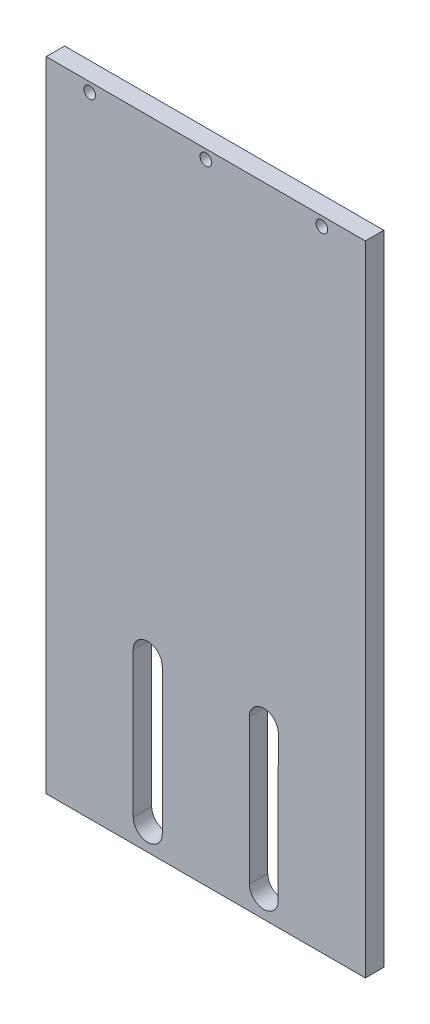
ISO-10303-21;
HEADER;
FILE_DESCRIPTION(('STEP AP214'),'2;1');
FILE_NAME('part.step','',(''),(''),'','','');
FILE_SCHEMA(('AUTOMOTIVE_DESIGN { 1 0 10303 214 1 1 1 1 }'));
ENDSEC;
DATA;
#1=APPLICATION_CONTEXT('core data for automotive mechanical design processes');
#2=APPLICATION_PROTOCOL_DEFINITION('international standard','automotive_design',2000,#1);
#3=PRODUCT_CONTEXT('',#1,'mechanical');
#4=PRODUCT('Part','Part','',(#3));
#5=PRODUCT_RELATED_PRODUCT_CATEGORY('part','',(#4));
#6=PRODUCT_DEFINITION_FORMATION('','',#4);
#7=PRODUCT_DEFINITION_CONTEXT('part definition',#1,'design');
#8=PRODUCT_DEFINITION('design','',#6,#7);
#9=PRODUCT_DEFINITION_SHAPE('','',#8);
#10=(LENGTH_UNIT() NAMED_UNIT(*) SI_UNIT(.MILLI.,.METRE.));
#11=(NAMED_UNIT(*) PLANE_ANGLE_UNIT() SI_UNIT($,.RADIAN.));
#12=(NAMED_UNIT(*) SI_UNIT($,.STERADIAN.) SOLID_ANGLE_UNIT());
#13=UNCERTAINTY_MEASURE_WITH_UNIT(LENGTH_MEASURE(1.E-05),#10,'distance_accuracy_value','');
#14=(GEOMETRIC_REPRESENTATION_CONTEXT(3) GLOBAL_UNCERTAINTY_ASSIGNED_CONTEXT((#13)) GLOBAL_UNIT_ASSIGNED_CONTEXT((#10,
#11,#12)) REPRESENTATION_CONTEXT('',''));
#15=CARTESIAN_POINT('',(0.,0.,0.));
#16=DIRECTION('',(0.,0.,1.));
#17=DIRECTION('',(1.,0.,0.));
#18=AXIS2_PLACEMENT_3D('',#15,#16,#17);
#19=CARTESIAN_POINT('',(0.,0.,6.35));
#20=DIRECTION('',(0.,0.,-1.));
#21=DIRECTION('',(-1.,0.,0.));
#22=AXIS2_PLACEMENT_3D('',#19,#20,#21);
#23=PLANE('',#22);
#24=CARTESIAN_POINT('',(0.,106.825,6.35));
#25=DIRECTION('',(0.,0.,1.));
#26=DIRECTION('',(1.,0.,0.));
#27=AXIS2_PLACEMENT_3D('',#24,#25,#26);
#28=CIRCLE('',#27,2.);
#29=CARTESIAN_POINT('',(2.,106.825,6.35));
#30=VERTEX_POINT('',#29);
#31=EDGE_CURVE('E158',#30,#30,#28,.T.);
#32=ORIENTED_EDGE('',*,*,#31,.F.);
#33=EDGE_LOOP('',(#32));
#34=FACE_BOUND('',#33,.T.);
#35=CARTESIAN_POINT('',(-40.,106.825,6.35));
#36=DIRECTION('',(0.,0.,1.));
#37=DIRECTION('',(1.,0.,0.));
#38=AXIS2_PLACEMENT_3D('',#35,#36,#37);
#39=CIRCLE('',#38,2.);
#40=CARTESIAN_POINT('',(-38.,106.825,6.35));
#41=VERTEX_POINT('',#40);
#42=EDGE_CURVE('E195',#41,#41,#39,.T.);
#43=ORIENTED_EDGE('',*,*,#42,.F.);
#44=EDGE_LOOP('',(#43));
#45=FACE_BOUND('',#44,.T.);
#46=DIRECTION('',(0.,1.,0.));
#47=VECTOR('',#46,1.);
#48=CARTESIAN_POINT('',(55.,-110.,6.35));
#49=LINE('',#48,#47);
#50=CARTESIAN_POINT('',(55.,-110.,6.35));
#51=VERTEX_POINT('',#50);
#52=CARTESIAN_POINT('',(55.,110.,6.35));
#53=VERTEX_POINT('',#52);
#54=EDGE_CURVE('E207',#51,#53,#49,.T.);
#55=ORIENTED_EDGE('',*,*,#54,.T.);
#56=DIRECTION('',(-1.,0.,0.));
#57=VECTOR('',#56,1.);
#58=CARTESIAN_POINT('',(-55.,110.,6.35));
#59=LINE('',#58,#57);
#60=CARTESIAN_POINT('',(-55.,110.,6.35));
#61=VERTEX_POINT('',#60);
#62=EDGE_CURVE('E210',#53,#61,#59,.T.);
#63=ORIENTED_EDGE('',*,*,#62,.T.);
#64=DIRECTION('',(0.,-1.,0.));
#65=VECTOR('',#64,1.);
#66=CARTESIAN_POINT('',(-55.,-110.,6.35));
#67=LINE('',#66,#65);
#68=CARTESIAN_POINT('',(-55.,-110.,6.35));
#69=VERTEX_POINT('',#68);
#70=EDGE_CURVE('E213',#61,#69,#67,.T.);
#71=ORIENTED_EDGE('',*,*,#70,.T.);
#72=DIRECTION('',(1.,0.,0.));
#73=VECTOR('',#72,1.);
#74=CARTESIAN_POINT('',(-55.,-110.,6.35));
#75=LINE('',#74,#73);
#76=EDGE_CURVE('E215',#69,#51,#75,.T.);
#77=ORIENTED_EDGE('',*,*,#76,.T.);
#78=EDGE_LOOP('',(#55,#63,#71,#77));
#79=FACE_BOUND('',#78,.T.);
#80=CARTESIAN_POINT('',(40.,106.825,6.35));
#81=DIRECTION('',(0.,0.,1.));
#82=DIRECTION('',(1.,0.,0.));
#83=AXIS2_PLACEMENT_3D('',#80,#81,#82);
#84=CIRCLE('',#83,2.);
#85=CARTESIAN_POINT('',(42.,106.825,6.35));
#86=VERTEX_POINT('',#85);
#87=EDGE_CURVE('E201',#86,#86,#84,.T.);
#88=ORIENTED_EDGE('',*,*,#87,.F.);
#89=EDGE_LOOP('',(#88));
#90=FACE_BOUND('',#89,.T.);
#91=CARTESIAN_POINT('',(20.,-52.,6.35));
#92=DIRECTION('',(0.,0.,1.));
#93=DIRECTION('',(1.,0.,0.));
#94=AXIS2_PLACEMENT_3D('',#91,#92,#93);
#95=CIRCLE('',#94,4.99999999999999);
#96=CARTESIAN_POINT('',(25.,-52.,6.35));
#97=VERTEX_POINT('',#96);
#98=CARTESIAN_POINT('',(15.,-52.,6.35));
#99=VERTEX_POINT('',#98);
#100=EDGE_CURVE('E164',#97,#99,#95,.T.);
#101=ORIENTED_EDGE('',*,*,#100,.F.);
#102=DIRECTION('',(0.00273615288829187,0.99999625672668,0.));
#103=VECTOR('',#102,1.);
#104=CARTESIAN_POINT('',(25.,-52.,6.35));
#105=LINE('',#104,#103);
#106=CARTESIAN_POINT('',(24.8599768517967,-103.175,6.35));
#107=VERTEX_POINT('',#106);
#108=EDGE_CURVE('E172',#107,#97,#105,.T.);
#109=ORIENTED_EDGE('',*,*,#108,.F.);
#110=CARTESIAN_POINT('',(20.,-102.,6.35));
#111=DIRECTION('',(0.,0.,1.));
#112=DIRECTION('',(1.,0.,0.));
#113=AXIS2_PLACEMENT_3D('',#110,#111,#112);
#114=CIRCLE('',#113,5.);
#115=CARTESIAN_POINT('',(15.,-102.,6.35));
#116=VERTEX_POINT('',#115);
#117=EDGE_CURVE('E169',#116,#107,#114,.T.);
#118=ORIENTED_EDGE('',*,*,#117,.F.);
#119=DIRECTION('',(0.,-1.,0.));
#120=VECTOR('',#119,1.);
#121=CARTESIAN_POINT('',(15.,-52.,6.35));
#122=LINE('',#121,#120);
#123=EDGE_CURVE('E166',#99,#116,#122,.T.);
#124=ORIENTED_EDGE('',*,*,#123,.F.);
#125=EDGE_LOOP('',(#101,#109,#118,#124));
#126=FACE_BOUND('',#125,.T.);
#127=CARTESIAN_POINT('',(-20.,-52.,6.35));
#128=DIRECTION('',(0.,0.,1.));
#129=DIRECTION('',(1.,0.,0.));
#130=AXIS2_PLACEMENT_3D('',#127,#128,#129);
#131=CIRCLE('',#130,5.);
#132=CARTESIAN_POINT('',(-15.,-52.,6.35));
#133=VERTEX_POINT('',#132);
#134=CARTESIAN_POINT('',(-25.,-52.,6.35));
#135=VERTEX_POINT('',#134);
#136=EDGE_CURVE('E122',#133,#135,#131,.T.);
#137=ORIENTED_EDGE('',*,*,#136,.F.);
#138=DIRECTION('',(0.,1.,0.));
#139=VECTOR('',#138,1.);
#140=CARTESIAN_POINT('',(-15.,-52.,6.35));
#141=LINE('',#140,#139);
#142=CARTESIAN_POINT('',(-15.,-102.,6.35));
#143=VERTEX_POINT('',#142);
#144=EDGE_CURVE('E144',#143,#133,#141,.T.);
#145=ORIENTED_EDGE('',*,*,#144,.F.);
#146=CARTESIAN_POINT('',(-20.,-102.,6.35));
#147=DIRECTION('',(0.,0.,1.));
#148=DIRECTION('',(1.,0.,0.));
#149=AXIS2_PLACEMENT_3D('',#146,#147,#148);
#150=CIRCLE('',#149,5.);
#151=CARTESIAN_POINT('',(-25.,-102.,6.35));
#152=VERTEX_POINT('',#151);
#153=EDGE_CURVE('E142',#152,#143,#150,.T.);
#154=ORIENTED_EDGE('',*,*,#153,.F.);
#155=DIRECTION('',(0.,-1.,0.));
#156=VECTOR('',#155,1.);
#157=CARTESIAN_POINT('',(-25.,-52.,6.35));
#158=LINE('',#157,#156);
#159=EDGE_CURVE('E130',#135,#152,#158,.T.);
#160=ORIENTED_EDGE('',*,*,#159,.F.);
#161=EDGE_LOOP('',(#137,#145,#154,#160));
#162=FACE_BOUND('',#161,.T.);
#163=ADVANCED_FACE('F33',(#34,#45,#79,#90,#126,#162),#23,.F.);
#164=CARTESIAN_POINT('',(0.,0.,0.));
#165=DIRECTION('',(0.,0.,-1.));
#166=DIRECTION('',(-1.,0.,0.));
#167=AXIS2_PLACEMENT_3D('',#164,#165,#166);
#168=PLANE('',#167);
#169=CARTESIAN_POINT('',(0.,106.825,0.));
#170=DIRECTION('',(0.,0.,1.));
#171=DIRECTION('',(1.,0.,0.));
#172=AXIS2_PLACEMENT_3D('',#169,#170,#171);
#173=CIRCLE('',#172,2.);
#174=CARTESIAN_POINT('',(2.,106.825,0.));
#175=VERTEX_POINT('',#174);
#176=EDGE_CURVE('E138',#175,#175,#173,.T.);
#177=ORIENTED_EDGE('',*,*,#176,.T.);
#178=EDGE_LOOP('',(#177));
#179=FACE_BOUND('',#178,.T.);
#180=CARTESIAN_POINT('',(-40.,106.825,0.));
#181=DIRECTION('',(0.,0.,1.));
#182=DIRECTION('',(1.,0.,0.));
#183=AXIS2_PLACEMENT_3D('',#180,#181,#182);
#184=CIRCLE('',#183,2.);
#185=CARTESIAN_POINT('',(-38.,106.825,0.));
#186=VERTEX_POINT('',#185);
#187=EDGE_CURVE('E194',#186,#186,#184,.T.);
#188=ORIENTED_EDGE('',*,*,#187,.T.);
#189=EDGE_LOOP('',(#188));
#190=FACE_BOUND('',#189,.T.);
#191=DIRECTION('',(0.,1.,0.));
#192=VECTOR('',#191,1.);
#193=CARTESIAN_POINT('',(55.,-110.,0.));
#194=LINE('',#193,#192);
#195=CARTESIAN_POINT('',(55.,-110.,0.));
#196=VERTEX_POINT('',#195);
#197=CARTESIAN_POINT('',(55.,110.,0.));
#198=VERTEX_POINT('',#197);
#199=EDGE_CURVE('E204',#196,#198,#194,.T.);
#200=ORIENTED_EDGE('',*,*,#199,.F.);
#201=DIRECTION('',(1.,0.,0.));
#202=VECTOR('',#201,1.);
#203=CARTESIAN_POINT('',(-55.,-110.,0.));
#204=LINE('',#203,#202);
#205=CARTESIAN_POINT('',(-55.,-110.,0.));
#206=VERTEX_POINT('',#205);
#207=EDGE_CURVE('E211',#206,#196,#204,.T.);
#208=ORIENTED_EDGE('',*,*,#207,.F.);
#209=DIRECTION('',(0.,-1.,0.));
#210=VECTOR('',#209,1.);
#211=CARTESIAN_POINT('',(-55.,-110.,0.));
#212=LINE('',#211,#210);
#213=CARTESIAN_POINT('',(-55.,110.,0.));
#214=VERTEX_POINT('',#213);
#215=EDGE_CURVE('E222',#214,#206,#212,.T.);
#216=ORIENTED_EDGE('',*,*,#215,.F.);
#217=DIRECTION('',(-1.,0.,0.));
#218=VECTOR('',#217,1.);
#219=CARTESIAN_POINT('',(-55.,110.,0.));
#220=LINE('',#219,#218);
#221=EDGE_CURVE('E220',#198,#214,#220,.T.);
#222=ORIENTED_EDGE('',*,*,#221,.F.);
#223=EDGE_LOOP('',(#200,#208,#216,#222));
#224=FACE_BOUND('',#223,.T.);
#225=CARTESIAN_POINT('',(40.,106.825,0.));
#226=DIRECTION('',(0.,0.,1.));
#227=DIRECTION('',(1.,0.,0.));
#228=AXIS2_PLACEMENT_3D('',#225,#226,#227);
#229=CIRCLE('',#228,2.);
#230=CARTESIAN_POINT('',(42.,106.825,0.));
#231=VERTEX_POINT('',#230);
#232=EDGE_CURVE('E198',#231,#231,#229,.T.);
#233=ORIENTED_EDGE('',*,*,#232,.T.);
#234=EDGE_LOOP('',(#233));
#235=FACE_BOUND('',#234,.T.);
#236=DIRECTION('',(0.00273615288829187,0.99999625672668,0.));
#237=VECTOR('',#236,1.);
#238=CARTESIAN_POINT('',(25.,-52.,0.));
#239=LINE('',#238,#237);
#240=CARTESIAN_POINT('',(24.8599768517967,-103.175,0.));
#241=VERTEX_POINT('',#240);
#242=CARTESIAN_POINT('',(25.,-52.,0.));
#243=VERTEX_POINT('',#242);
#244=EDGE_CURVE('E167',#241,#243,#239,.T.);
#245=ORIENTED_EDGE('',*,*,#244,.T.);
#246=CARTESIAN_POINT('',(20.,-52.,0.));
#247=DIRECTION('',(0.,0.,1.));
#248=DIRECTION('',(1.,0.,0.));
#249=AXIS2_PLACEMENT_3D('',#246,#247,#248);
#250=CIRCLE('',#249,4.99999999999999);
#251=CARTESIAN_POINT('',(15.,-52.,0.));
#252=VERTEX_POINT('',#251);
#253=EDGE_CURVE('E161',#243,#252,#250,.T.);
#254=ORIENTED_EDGE('',*,*,#253,.T.);
#255=DIRECTION('',(0.,-1.,0.));
#256=VECTOR('',#255,1.);
#257=CARTESIAN_POINT('',(15.,-52.,0.));
#258=LINE('',#257,#256);
#259=CARTESIAN_POINT('',(15.,-102.,0.));
#260=VERTEX_POINT('',#259);
#261=EDGE_CURVE('E177',#252,#260,#258,.T.);
#262=ORIENTED_EDGE('',*,*,#261,.T.);
#263=CARTESIAN_POINT('',(20.,-102.,0.));
#264=DIRECTION('',(0.,0.,1.));
#265=DIRECTION('',(1.,0.,0.));
#266=AXIS2_PLACEMENT_3D('',#263,#264,#265);
#267=CIRCLE('',#266,5.);
#268=EDGE_CURVE('E180',#260,#241,#267,.T.);
#269=ORIENTED_EDGE('',*,*,#268,.T.);
#270=EDGE_LOOP('',(#245,#254,#262,#269));
#271=FACE_BOUND('',#270,.T.);
#272=DIRECTION('',(0.,1.,0.));
#273=VECTOR('',#272,1.);
#274=CARTESIAN_POINT('',(-15.,-52.,0.));
#275=LINE('',#274,#273);
#276=CARTESIAN_POINT('',(-15.,-102.,0.));
#277=VERTEX_POINT('',#276);
#278=CARTESIAN_POINT('',(-15.,-52.,0.));
#279=VERTEX_POINT('',#278);
#280=EDGE_CURVE('E131',#277,#279,#275,.T.);
#281=ORIENTED_EDGE('',*,*,#280,.T.);
#282=CARTESIAN_POINT('',(-20.,-52.,0.));
#283=DIRECTION('',(0.,0.,1.));
#284=DIRECTION('',(1.,0.,0.));
#285=AXIS2_PLACEMENT_3D('',#282,#283,#284);
#286=CIRCLE('',#285,5.);
#287=CARTESIAN_POINT('',(-25.,-52.,0.));
#288=VERTEX_POINT('',#287);
#289=EDGE_CURVE('E56',#279,#288,#286,.T.);
#290=ORIENTED_EDGE('',*,*,#289,.T.);
#291=DIRECTION('',(0.,-1.,0.));
#292=VECTOR('',#291,1.);
#293=CARTESIAN_POINT('',(-25.,-52.,0.));
#294=LINE('',#293,#292);
#295=CARTESIAN_POINT('',(-25.,-102.,0.));
#296=VERTEX_POINT('',#295);
#297=EDGE_CURVE('E137',#288,#296,#294,.T.);
#298=ORIENTED_EDGE('',*,*,#297,.T.);
#299=CARTESIAN_POINT('',(-20.,-102.,0.));
#300=DIRECTION('',(0.,0.,1.));
#301=DIRECTION('',(1.,0.,0.));
#302=AXIS2_PLACEMENT_3D('',#299,#300,#301);
#303=CIRCLE('',#302,5.);
#304=EDGE_CURVE('E150',#296,#277,#303,.T.);
#305=ORIENTED_EDGE('',*,*,#304,.T.);
#306=EDGE_LOOP('',(#281,#290,#298,#305));
#307=FACE_BOUND('',#306,.T.);
#308=ADVANCED_FACE('F240',(#179,#190,#224,#235,#271,#307),#168,.T.);
#309=CARTESIAN_POINT('',(55.,-110.,6.35));
#310=DIRECTION('',(-1.,0.,0.));
#311=DIRECTION('',(0.,0.,1.));
#312=AXIS2_PLACEMENT_3D('',#309,#310,#311);
#313=PLANE('',#312);
#314=ORIENTED_EDGE('',*,*,#199,.T.);
#315=DIRECTION('',(0.,0.,-1.));
#316=VECTOR('',#315,1.);
#317=CARTESIAN_POINT('',(55.,110.,6.35));
#318=LINE('',#317,#316);
#319=EDGE_CURVE('E11',#53,#198,#318,.T.);
#320=ORIENTED_EDGE('',*,*,#319,.F.);
#321=ORIENTED_EDGE('',*,*,#54,.F.);
#322=DIRECTION('',(0.,0.,-1.));
#323=VECTOR('',#322,1.);
#324=CARTESIAN_POINT('',(55.,-110.,6.35));
#325=LINE('',#324,#323);
#326=EDGE_CURVE('E217',#51,#196,#325,.T.);
#327=ORIENTED_EDGE('',*,*,#326,.T.);
#328=EDGE_LOOP('',(#314,#320,#321,#327));
#329=FACE_BOUND('',#328,.T.);
#330=ADVANCED_FACE('F35',(#329),#313,.F.);
#331=CARTESIAN_POINT('',(-55.,110.,6.35));
#332=DIRECTION('',(0.,-1.,0.));
#333=DIRECTION('',(0.,0.,-1.));
#334=AXIS2_PLACEMENT_3D('',#331,#332,#333);
#335=PLANE('',#334);
#336=ORIENTED_EDGE('',*,*,#221,.T.);
#337=DIRECTION('',(0.,0.,-1.));
#338=VECTOR('',#337,1.);
#339=CARTESIAN_POINT('',(-55.,110.,6.35));
#340=LINE('',#339,#338);
#341=EDGE_CURVE('E41',#61,#214,#340,.T.);
#342=ORIENTED_EDGE('',*,*,#341,.F.);
#343=ORIENTED_EDGE('',*,*,#62,.F.);
#344=ORIENTED_EDGE('',*,*,#319,.T.);
#345=EDGE_LOOP('',(#336,#342,#343,#344));
#346=FACE_BOUND('',#345,.T.);
#347=ADVANCED_FACE('F251',(#346),#335,.F.);
#348=CARTESIAN_POINT('',(-55.,-110.,6.35));
#349=DIRECTION('',(1.,0.,0.));
#350=DIRECTION('',(0.,0.,-1.));
#351=AXIS2_PLACEMENT_3D('',#348,#349,#350);
#352=PLANE('',#351);
#353=ORIENTED_EDGE('',*,*,#215,.T.);
#354=DIRECTION('',(0.,0.,-1.));
#355=VECTOR('',#354,1.);
#356=CARTESIAN_POINT('',(-55.,-110.,6.35));
#357=LINE('',#356,#355);
#358=EDGE_CURVE('E227',#69,#206,#357,.T.);
#359=ORIENTED_EDGE('',*,*,#358,.F.);
#360=ORIENTED_EDGE('',*,*,#70,.F.);
#361=ORIENTED_EDGE('',*,*,#341,.T.);
#362=EDGE_LOOP('',(#353,#359,#360,#361));
#363=FACE_BOUND('',#362,.T.);
#364=ADVANCED_FACE('F234',(#363),#352,.F.);
#365=CARTESIAN_POINT('',(-55.,-110.,6.35));
#366=DIRECTION('',(0.,1.,0.));
#367=DIRECTION('',(0.,0.,1.));
#368=AXIS2_PLACEMENT_3D('',#365,#366,#367);
#369=PLANE('',#368);
#370=ORIENTED_EDGE('',*,*,#207,.T.);
#371=ORIENTED_EDGE('',*,*,#326,.F.);
#372=ORIENTED_EDGE('',*,*,#76,.F.);
#373=ORIENTED_EDGE('',*,*,#358,.T.);
#374=EDGE_LOOP('',(#370,#371,#372,#373));
#375=FACE_BOUND('',#374,.T.);
#376=ADVANCED_FACE('F244',(#375),#369,.F.);
#377=CARTESIAN_POINT('',(40.,106.825,6.35));
#378=DIRECTION('',(0.,0.,-1.));
#379=DIRECTION('',(-1.,0.,0.));
#380=AXIS2_PLACEMENT_3D('',#377,#378,#379);
#381=CYLINDRICAL_SURFACE('',#380,2.);
#382=ORIENTED_EDGE('',*,*,#87,.T.);
#383=EDGE_LOOP('',(#382));
#384=FACE_BOUND('',#383,.T.);
#385=ORIENTED_EDGE('',*,*,#232,.F.);
#386=EDGE_LOOP('',(#385));
#387=FACE_BOUND('',#386,.T.);
#388=ADVANCED_FACE('F269',(#384,#387),#381,.F.);
#389=CARTESIAN_POINT('',(-40.,106.825,6.35));
#390=DIRECTION('',(0.,0.,-1.));
#391=DIRECTION('',(-1.,0.,0.));
#392=AXIS2_PLACEMENT_3D('',#389,#390,#391);
#393=CYLINDRICAL_SURFACE('',#392,2.);
#394=ORIENTED_EDGE('',*,*,#42,.T.);
#395=EDGE_LOOP('',(#394));
#396=FACE_BOUND('',#395,.T.);
#397=ORIENTED_EDGE('',*,*,#187,.F.);
#398=EDGE_LOOP('',(#397));
#399=FACE_BOUND('',#398,.T.);
#400=ADVANCED_FACE('F276',(#396,#399),#393,.F.);
#401=CARTESIAN_POINT('',(20.,-52.,6.35));
#402=DIRECTION('',(0.,0.,-1.));
#403=DIRECTION('',(-1.,0.,0.));
#404=AXIS2_PLACEMENT_3D('',#401,#402,#403);
#405=CYLINDRICAL_SURFACE('',#404,4.99999999999999);
#406=ORIENTED_EDGE('',*,*,#253,.F.);
#407=DIRECTION('',(0.,0.,-1.));
#408=VECTOR('',#407,1.);
#409=CARTESIAN_POINT('',(25.,-52.,6.35));
#410=LINE('',#409,#408);
#411=EDGE_CURVE('E174',#97,#243,#410,.T.);
#412=ORIENTED_EDGE('',*,*,#411,.F.);
#413=ORIENTED_EDGE('',*,*,#100,.T.);
#414=DIRECTION('',(0.,0.,-1.));
#415=VECTOR('',#414,1.);
#416=CARTESIAN_POINT('',(15.,-52.,6.35));
#417=LINE('',#416,#415);
#418=EDGE_CURVE('E191',#99,#252,#417,.T.);
#419=ORIENTED_EDGE('',*,*,#418,.T.);
#420=EDGE_LOOP('',(#406,#412,#413,#419));
#421=FACE_BOUND('',#420,.T.);
#422=ADVANCED_FACE('F281',(#421),#405,.F.);
#423=CARTESIAN_POINT('',(15.,-52.,6.35));
#424=DIRECTION('',(1.,0.,0.));
#425=DIRECTION('',(0.,1.,0.));
#426=AXIS2_PLACEMENT_3D('',#423,#424,#425);
#427=PLANE('',#426);
#428=ORIENTED_EDGE('',*,*,#261,.F.);
#429=ORIENTED_EDGE('',*,*,#418,.F.);
#430=ORIENTED_EDGE('',*,*,#123,.T.);
#431=DIRECTION('',(0.,0.,-1.));
#432=VECTOR('',#431,1.);
#433=CARTESIAN_POINT('',(15.,-102.,6.35));
#434=LINE('',#433,#432);
#435=EDGE_CURVE('E189',#116,#260,#434,.T.);
#436=ORIENTED_EDGE('',*,*,#435,.T.);
#437=EDGE_LOOP('',(#428,#429,#430,#436));
#438=FACE_BOUND('',#437,.T.);
#439=ADVANCED_FACE('F315',(#438),#427,.T.);
#440=CARTESIAN_POINT('',(20.,-102.,6.35));
#441=DIRECTION('',(0.,0.,-1.));
#442=DIRECTION('',(-1.,0.,0.));
#443=AXIS2_PLACEMENT_3D('',#440,#441,#442);
#444=CYLINDRICAL_SURFACE('',#443,5.);
#445=ORIENTED_EDGE('',*,*,#268,.F.);
#446=ORIENTED_EDGE('',*,*,#435,.F.);
#447=ORIENTED_EDGE('',*,*,#117,.T.);
#448=DIRECTION('',(0.,0.,-1.));
#449=VECTOR('',#448,1.);
#450=CARTESIAN_POINT('',(24.8599768517967,-103.175,6.35));
#451=LINE('',#450,#449);
#452=EDGE_CURVE('E187',#107,#241,#451,.T.);
#453=ORIENTED_EDGE('',*,*,#452,.T.);
#454=EDGE_LOOP('',(#445,#446,#447,#453));
#455=FACE_BOUND('',#454,.T.);
#456=ADVANCED_FACE('F311',(#455),#444,.F.);
#457=CARTESIAN_POINT('',(25.,-52.,6.35));
#458=DIRECTION('',(-0.99999625672668,0.00273615288829187,0.));
#459=DIRECTION('',(-0.00273615288829187,-0.99999625672668,0.));
#460=AXIS2_PLACEMENT_3D('',#457,#458,#459);
#461=PLANE('',#460);
#462=ORIENTED_EDGE('',*,*,#244,.F.);
#463=ORIENTED_EDGE('',*,*,#452,.F.);
#464=ORIENTED_EDGE('',*,*,#108,.T.);
#465=ORIENTED_EDGE('',*,*,#411,.T.);
#466=EDGE_LOOP('',(#462,#463,#464,#465));
#467=FACE_BOUND('',#466,.T.);
#468=ADVANCED_FACE('F307',(#467),#461,.T.);
#469=CARTESIAN_POINT('',(0.,106.825,6.35));
#470=DIRECTION('',(0.,0.,-1.));
#471=DIRECTION('',(-1.,0.,0.));
#472=AXIS2_PLACEMENT_3D('',#469,#470,#471);
#473=CYLINDRICAL_SURFACE('',#472,2.);
#474=ORIENTED_EDGE('',*,*,#31,.T.);
#475=EDGE_LOOP('',(#474));
#476=FACE_BOUND('',#475,.T.);
#477=ORIENTED_EDGE('',*,*,#176,.F.);
#478=EDGE_LOOP('',(#477));
#479=FACE_BOUND('',#478,.T.);
#480=ADVANCED_FACE('F304',(#476,#479),#473,.F.);
#481=CARTESIAN_POINT('',(-20.,-52.,6.35));
#482=DIRECTION('',(0.,0.,-1.));
#483=DIRECTION('',(-1.,0.,0.));
#484=AXIS2_PLACEMENT_3D('',#481,#482,#483);
#485=CYLINDRICAL_SURFACE('',#484,5.);
#486=ORIENTED_EDGE('',*,*,#289,.F.);
#487=DIRECTION('',(0.,0.,-1.));
#488=VECTOR('',#487,1.);
#489=CARTESIAN_POINT('',(-15.,-52.,6.35));
#490=LINE('',#489,#488);
#491=EDGE_CURVE('E126',#133,#279,#490,.T.);
#492=ORIENTED_EDGE('',*,*,#491,.F.);
#493=ORIENTED_EDGE('',*,*,#136,.T.);
#494=DIRECTION('',(0.,0.,-1.));
#495=VECTOR('',#494,1.);
#496=CARTESIAN_POINT('',(-25.,-52.,6.35));
#497=LINE('',#496,#495);
#498=EDGE_CURVE('E125',#135,#288,#497,.T.);
#499=ORIENTED_EDGE('',*,*,#498,.T.);
#500=EDGE_LOOP('',(#486,#492,#493,#499));
#501=FACE_BOUND('',#500,.T.);
#502=ADVANCED_FACE('F124',(#501),#485,.F.);
#503=CARTESIAN_POINT('',(-25.,-52.,6.35));
#504=DIRECTION('',(1.,0.,0.));
#505=DIRECTION('',(0.,1.,0.));
#506=AXIS2_PLACEMENT_3D('',#503,#504,#505);
#507=PLANE('',#506);
#508=ORIENTED_EDGE('',*,*,#297,.F.);
#509=ORIENTED_EDGE('',*,*,#498,.F.);
#510=ORIENTED_EDGE('',*,*,#159,.T.);
#511=DIRECTION('',(0.,0.,-1.));
#512=VECTOR('',#511,1.);
#513=CARTESIAN_POINT('',(-25.,-102.,6.35));
#514=LINE('',#513,#512);
#515=EDGE_CURVE('E139',#152,#296,#514,.T.);
#516=ORIENTED_EDGE('',*,*,#515,.T.);
#517=EDGE_LOOP('',(#508,#509,#510,#516));
#518=FACE_BOUND('',#517,.T.);
#519=ADVANCED_FACE('F134',(#518),#507,.T.);
#520=CARTESIAN_POINT('',(-20.,-102.,6.35));
#521=DIRECTION('',(0.,0.,-1.));
#522=DIRECTION('',(-1.,0.,0.));
#523=AXIS2_PLACEMENT_3D('',#520,#521,#522);
#524=CYLINDRICAL_SURFACE('',#523,5.);
#525=ORIENTED_EDGE('',*,*,#304,.F.);
#526=ORIENTED_EDGE('',*,*,#515,.F.);
#527=ORIENTED_EDGE('',*,*,#153,.T.);
#528=DIRECTION('',(0.,0.,-1.));
#529=VECTOR('',#528,1.);
#530=CARTESIAN_POINT('',(-15.,-102.,6.35));
#531=LINE('',#530,#529);
#532=EDGE_CURVE('E48',#143,#277,#531,.T.);
#533=ORIENTED_EDGE('',*,*,#532,.T.);
#534=EDGE_LOOP('',(#525,#526,#527,#533));
#535=FACE_BOUND('',#534,.T.);
#536=ADVANCED_FACE('F292',(#535),#524,.F.);
#537=CARTESIAN_POINT('',(-15.,-52.,6.35));
#538=DIRECTION('',(-1.,0.,0.));
#539=DIRECTION('',(0.,-1.,0.));
#540=AXIS2_PLACEMENT_3D('',#537,#538,#539);
#541=PLANE('',#540);
#542=ORIENTED_EDGE('',*,*,#280,.F.);
#543=ORIENTED_EDGE('',*,*,#532,.F.);
#544=ORIENTED_EDGE('',*,*,#144,.T.);
#545=ORIENTED_EDGE('',*,*,#491,.T.);
#546=EDGE_LOOP('',(#542,#543,#544,#545));
#547=FACE_BOUND('',#546,.T.);
#548=ADVANCED_FACE('F290',(#547),#541,.T.);
#549=CLOSED_SHELL('',(#163,#308,#330,#347,#364,#376,#388,#400,#422,#439,#456,#468,#480,#502,
#519,#536,#548));
#550=MANIFOLD_SOLID_BREP('B2',#549);
#551=ADVANCED_BREP_SHAPE_REPRESENTATION('',(#18,#550),#14);
#552=SHAPE_DEFINITION_REPRESENTATION(#9,#551);
ENDSEC;
END-ISO-10303-21;
